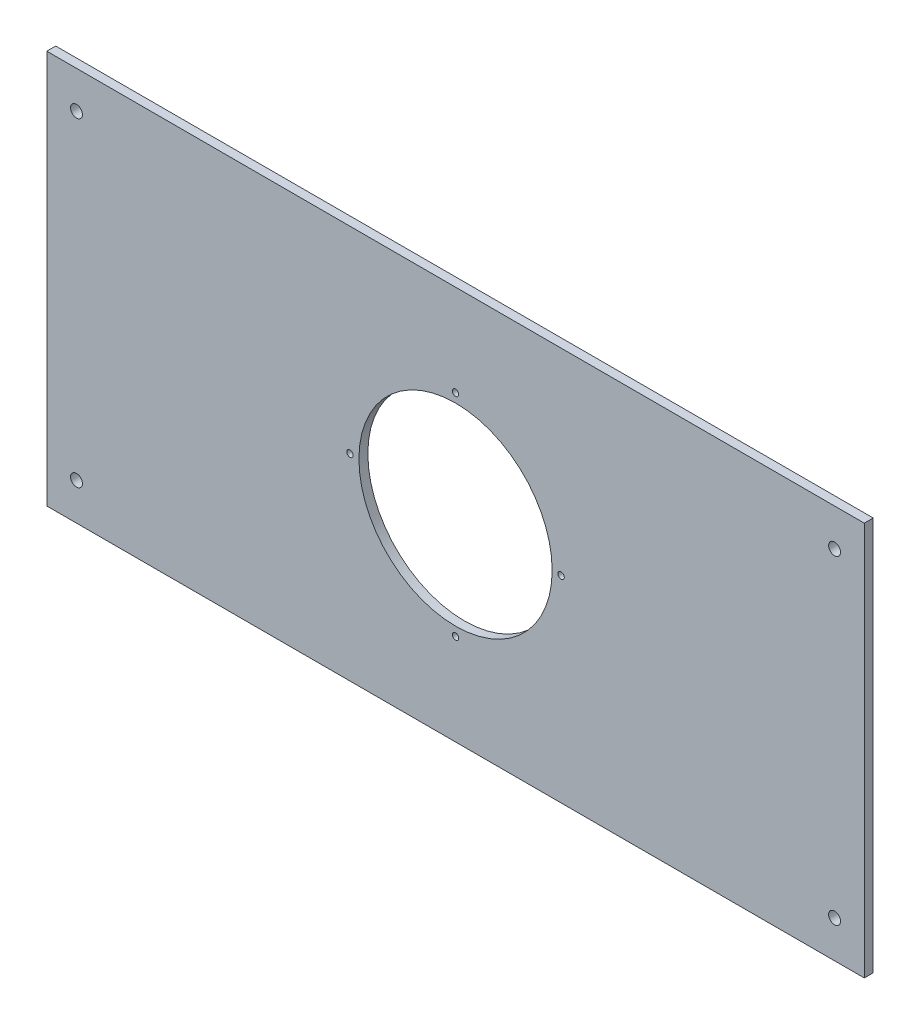
ISO-10303-21;
HEADER;
FILE_DESCRIPTION(('STEP AP214'),'2;1');
FILE_NAME('part.step','',(''),(''),'','','');
FILE_SCHEMA(('AUTOMOTIVE_DESIGN { 1 0 10303 214 1 1 1 1 }'));
ENDSEC;
DATA;
#1=APPLICATION_CONTEXT('core data for automotive mechanical design processes');
#2=APPLICATION_PROTOCOL_DEFINITION('international standard','automotive_design',2000,#1);
#3=PRODUCT_CONTEXT('',#1,'mechanical');
#4=PRODUCT('Part','Part','',(#3));
#5=PRODUCT_RELATED_PRODUCT_CATEGORY('part','',(#4));
#6=PRODUCT_DEFINITION_FORMATION('','',#4);
#7=PRODUCT_DEFINITION_CONTEXT('part definition',#1,'design');
#8=PRODUCT_DEFINITION('design','',#6,#7);
#9=PRODUCT_DEFINITION_SHAPE('','',#8);
#10=(LENGTH_UNIT() NAMED_UNIT(*) SI_UNIT(.MILLI.,.METRE.));
#11=(NAMED_UNIT(*) PLANE_ANGLE_UNIT() SI_UNIT($,.RADIAN.));
#12=(NAMED_UNIT(*) SI_UNIT($,.STERADIAN.) SOLID_ANGLE_UNIT());
#13=UNCERTAINTY_MEASURE_WITH_UNIT(LENGTH_MEASURE(1.E-05),#10,'distance_accuracy_value','');
#14=(GEOMETRIC_REPRESENTATION_CONTEXT(3) GLOBAL_UNCERTAINTY_ASSIGNED_CONTEXT((#13)) GLOBAL_UNIT_ASSIGNED_CONTEXT((#10,
#11,#12)) REPRESENTATION_CONTEXT('',''));
#15=CARTESIAN_POINT('',(0.,0.,0.));
#16=DIRECTION('',(0.,0.,1.));
#17=DIRECTION('',(1.,0.,0.));
#18=AXIS2_PLACEMENT_3D('',#15,#16,#17);
#19=CARTESIAN_POINT('',(-180.633802816901,158.529929577465,6.));
#20=DIRECTION('',(1.,0.,0.));
#21=DIRECTION('',(0.,1.,0.));
#22=AXIS2_PLACEMENT_3D('',#19,#20,#21);
#23=PLANE('',#22);
#24=DIRECTION('',(0.,-1.,0.));
#25=VECTOR('',#24,1.);
#26=CARTESIAN_POINT('',(-180.633802816901,158.529929577465,0.));
#27=LINE('',#26,#25);
#28=CARTESIAN_POINT('',(-180.633802816901,158.529929577465,0.));
#29=VERTEX_POINT('',#28);
#30=CARTESIAN_POINT('',(-180.633802816901,-106.470070422535,0.));
#31=VERTEX_POINT('',#30);
#32=EDGE_CURVE('E104',#29,#31,#27,.T.);
#33=ORIENTED_EDGE('',*,*,#32,.T.);
#34=DIRECTION('',(0.,0.,-1.));
#35=VECTOR('',#34,1.);
#36=CARTESIAN_POINT('',(-180.633802816901,-106.470070422535,6.));
#37=LINE('',#36,#35);
#38=CARTESIAN_POINT('',(-180.633802816901,-106.470070422535,6.));
#39=VERTEX_POINT('',#38);
#40=EDGE_CURVE('E11',#39,#31,#37,.T.);
#41=ORIENTED_EDGE('',*,*,#40,.F.);
#42=DIRECTION('',(0.,-1.,0.));
#43=VECTOR('',#42,1.);
#44=CARTESIAN_POINT('',(-180.633802816901,158.529929577465,6.));
#45=LINE('',#44,#43);
#46=CARTESIAN_POINT('',(-180.633802816901,158.529929577465,6.));
#47=VERTEX_POINT('',#46);
#48=EDGE_CURVE('E92',#47,#39,#45,.T.);
#49=ORIENTED_EDGE('',*,*,#48,.F.);
#50=DIRECTION('',(0.,0.,-1.));
#51=VECTOR('',#50,1.);
#52=CARTESIAN_POINT('',(-180.633802816901,158.529929577465,6.));
#53=LINE('',#52,#51);
#54=EDGE_CURVE('E100',#47,#29,#53,.T.);
#55=ORIENTED_EDGE('',*,*,#54,.T.);
#56=EDGE_LOOP('',(#33,#41,#49,#55));
#57=FACE_BOUND('',#56,.T.);
#58=ADVANCED_FACE('F41',(#57),#23,.F.);
#59=CARTESIAN_POINT('',(-180.633802816901,-106.470070422535,6.));
#60=DIRECTION('',(0.,1.,0.));
#61=DIRECTION('',(0.,0.,1.));
#62=AXIS2_PLACEMENT_3D('',#59,#60,#61);
#63=PLANE('',#62);
#64=DIRECTION('',(1.,0.,0.));
#65=VECTOR('',#64,1.);
#66=CARTESIAN_POINT('',(-180.633802816901,-106.470070422535,0.));
#67=LINE('',#66,#65);
#68=CARTESIAN_POINT('',(369.366197183099,-106.470070422535,0.));
#69=VERTEX_POINT('',#68);
#70=EDGE_CURVE('E96',#31,#69,#67,.T.);
#71=ORIENTED_EDGE('',*,*,#70,.T.);
#72=DIRECTION('',(0.,0.,-1.));
#73=VECTOR('',#72,1.);
#74=CARTESIAN_POINT('',(369.366197183099,-106.470070422535,6.));
#75=LINE('',#74,#73);
#76=CARTESIAN_POINT('',(369.366197183099,-106.470070422535,6.));
#77=VERTEX_POINT('',#76);
#78=EDGE_CURVE('E49',#77,#69,#75,.T.);
#79=ORIENTED_EDGE('',*,*,#78,.F.);
#80=DIRECTION('',(1.,0.,0.));
#81=VECTOR('',#80,1.);
#82=CARTESIAN_POINT('',(-180.633802816901,-106.470070422535,6.));
#83=LINE('',#82,#81);
#84=EDGE_CURVE('E87',#39,#77,#83,.T.);
#85=ORIENTED_EDGE('',*,*,#84,.F.);
#86=ORIENTED_EDGE('',*,*,#40,.T.);
#87=EDGE_LOOP('',(#71,#79,#85,#86));
#88=FACE_BOUND('',#87,.T.);
#89=ADVANCED_FACE('F95',(#88),#63,.F.);
#90=CARTESIAN_POINT('',(369.366197183099,158.529929577465,6.));
#91=DIRECTION('',(-1.,0.,0.));
#92=DIRECTION('',(0.,0.,1.));
#93=AXIS2_PLACEMENT_3D('',#90,#91,#92);
#94=PLANE('',#93);
#95=DIRECTION('',(0.,1.,0.));
#96=VECTOR('',#95,1.);
#97=CARTESIAN_POINT('',(369.366197183099,158.529929577465,0.));
#98=LINE('',#97,#96);
#99=CARTESIAN_POINT('',(369.366197183099,158.529929577465,0.));
#100=VERTEX_POINT('',#99);
#101=EDGE_CURVE('E74',#69,#100,#98,.T.);
#102=ORIENTED_EDGE('',*,*,#101,.T.);
#103=DIRECTION('',(0.,0.,-1.));
#104=VECTOR('',#103,1.);
#105=CARTESIAN_POINT('',(369.366197183099,158.529929577465,6.));
#106=LINE('',#105,#104);
#107=CARTESIAN_POINT('',(369.366197183099,158.529929577465,6.));
#108=VERTEX_POINT('',#107);
#109=EDGE_CURVE('E97',#108,#100,#106,.T.);
#110=ORIENTED_EDGE('',*,*,#109,.F.);
#111=DIRECTION('',(0.,1.,0.));
#112=VECTOR('',#111,1.);
#113=CARTESIAN_POINT('',(369.366197183099,158.529929577465,6.));
#114=LINE('',#113,#112);
#115=EDGE_CURVE('E90',#77,#108,#114,.T.);
#116=ORIENTED_EDGE('',*,*,#115,.F.);
#117=ORIENTED_EDGE('',*,*,#78,.T.);
#118=EDGE_LOOP('',(#102,#110,#116,#117));
#119=FACE_BOUND('',#118,.T.);
#120=ADVANCED_FACE('F98',(#119),#94,.F.);
#121=CARTESIAN_POINT('',(-180.633802816901,158.529929577465,6.));
#122=DIRECTION('',(0.,-1.,0.));
#123=DIRECTION('',(0.,0.,-1.));
#124=AXIS2_PLACEMENT_3D('',#121,#122,#123);
#125=PLANE('',#124);
#126=DIRECTION('',(-1.,0.,0.));
#127=VECTOR('',#126,1.);
#128=CARTESIAN_POINT('',(-180.633802816901,158.529929577465,0.));
#129=LINE('',#128,#127);
#130=EDGE_CURVE('E80',#100,#29,#129,.T.);
#131=ORIENTED_EDGE('',*,*,#130,.T.);
#132=ORIENTED_EDGE('',*,*,#54,.F.);
#133=DIRECTION('',(-1.,0.,0.));
#134=VECTOR('',#133,1.);
#135=CARTESIAN_POINT('',(-180.633802816901,158.529929577465,6.));
#136=LINE('',#135,#134);
#137=EDGE_CURVE('E57',#108,#47,#136,.T.);
#138=ORIENTED_EDGE('',*,*,#137,.F.);
#139=ORIENTED_EDGE('',*,*,#109,.T.);
#140=EDGE_LOOP('',(#131,#132,#138,#139));
#141=FACE_BOUND('',#140,.T.);
#142=ADVANCED_FACE('F112',(#141),#125,.F.);
#143=CARTESIAN_POINT('',(0.,0.,6.));
#144=DIRECTION('',(0.,0.,1.));
#145=DIRECTION('',(1.,0.,0.));
#146=AXIS2_PLACEMENT_3D('',#143,#144,#145);
#147=PLANE('',#146);
#148=CARTESIAN_POINT('',(94.3661971830987,97.0299295774648,6.));
#149=DIRECTION('',(0.,0.,1.));
#150=DIRECTION('',(1.,0.,0.));
#151=AXIS2_PLACEMENT_3D('',#148,#149,#150);
#152=CIRCLE('',#151,2.15);
#153=CARTESIAN_POINT('',(96.5161971830987,97.0299295774648,6.));
#154=VERTEX_POINT('',#153);
#155=EDGE_CURVE('E123',#154,#154,#152,.T.);
#156=ORIENTED_EDGE('',*,*,#155,.F.);
#157=EDGE_LOOP('',(#156));
#158=FACE_BOUND('',#157,.T.);
#159=CARTESIAN_POINT('',(-160.633802816901,133.529929577465,6.));
#160=DIRECTION('',(0.,0.,1.));
#161=DIRECTION('',(1.,0.,0.));
#162=AXIS2_PLACEMENT_3D('',#159,#160,#161);
#163=CIRCLE('',#162,3.99999999999999);
#164=CARTESIAN_POINT('',(-156.633802816901,133.529929577465,6.));
#165=VERTEX_POINT('',#164);
#166=EDGE_CURVE('E138',#165,#165,#163,.T.);
#167=ORIENTED_EDGE('',*,*,#166,.F.);
#168=EDGE_LOOP('',(#167));
#169=FACE_BOUND('',#168,.T.);
#170=CARTESIAN_POINT('',(165.366197183099,26.0299295774648,6.));
#171=DIRECTION('',(0.,0.,1.));
#172=DIRECTION('',(1.,0.,0.));
#173=AXIS2_PLACEMENT_3D('',#170,#171,#172);
#174=CIRCLE('',#173,2.15000000000002);
#175=CARTESIAN_POINT('',(167.516197183099,26.0299295774648,6.));
#176=VERTEX_POINT('',#175);
#177=EDGE_CURVE('E132',#176,#176,#174,.T.);
#178=ORIENTED_EDGE('',*,*,#177,.F.);
#179=EDGE_LOOP('',(#178));
#180=FACE_BOUND('',#179,.T.);
#181=CARTESIAN_POINT('',(94.3661971830987,-44.9700704225351,6.));
#182=DIRECTION('',(0.,0.,1.));
#183=DIRECTION('',(1.,0.,0.));
#184=AXIS2_PLACEMENT_3D('',#181,#182,#183);
#185=CIRCLE('',#184,2.15);
#186=CARTESIAN_POINT('',(96.5161971830987,-44.9700704225351,6.));
#187=VERTEX_POINT('',#186);
#188=EDGE_CURVE('E124',#187,#187,#185,.T.);
#189=ORIENTED_EDGE('',*,*,#188,.F.);
#190=EDGE_LOOP('',(#189));
#191=FACE_BOUND('',#190,.T.);
#192=CARTESIAN_POINT('',(23.3661971830987,26.0299295774648,6.));
#193=DIRECTION('',(0.,0.,1.));
#194=DIRECTION('',(1.,0.,0.));
#195=AXIS2_PLACEMENT_3D('',#192,#193,#194);
#196=CIRCLE('',#195,2.15000000000001);
#197=CARTESIAN_POINT('',(25.5161971830987,26.0299295774648,6.));
#198=VERTEX_POINT('',#197);
#199=EDGE_CURVE('E131',#198,#198,#196,.T.);
#200=ORIENTED_EDGE('',*,*,#199,.F.);
#201=EDGE_LOOP('',(#200));
#202=FACE_BOUND('',#201,.T.);
#203=CARTESIAN_POINT('',(349.366197183099,133.529929577465,6.));
#204=DIRECTION('',(0.,0.,1.));
#205=DIRECTION('',(-1.,0.,0.));
#206=AXIS2_PLACEMENT_3D('',#203,#204,#205);
#207=CIRCLE('',#206,3.99999999999999);
#208=CARTESIAN_POINT('',(345.366197183099,133.529929577465,6.));
#209=VERTEX_POINT('',#208);
#210=EDGE_CURVE('E161',#209,#209,#207,.T.);
#211=ORIENTED_EDGE('',*,*,#210,.F.);
#212=EDGE_LOOP('',(#211));
#213=FACE_BOUND('',#212,.T.);
#214=CARTESIAN_POINT('',(349.366197183099,-81.4700704225355,6.));
#215=DIRECTION('',(0.,0.,1.));
#216=DIRECTION('',(1.,0.,0.));
#217=AXIS2_PLACEMENT_3D('',#214,#215,#216);
#218=CIRCLE('',#217,3.99999999999999);
#219=CARTESIAN_POINT('',(353.366197183099,-81.4700704225355,6.));
#220=VERTEX_POINT('',#219);
#221=EDGE_CURVE('E155',#220,#220,#218,.T.);
#222=ORIENTED_EDGE('',*,*,#221,.F.);
#223=EDGE_LOOP('',(#222));
#224=FACE_BOUND('',#223,.T.);
#225=CARTESIAN_POINT('',(-160.633802816901,-81.4700704225353,6.));
#226=DIRECTION('',(0.,0.,1.));
#227=DIRECTION('',(-1.,0.,0.));
#228=AXIS2_PLACEMENT_3D('',#225,#226,#227);
#229=CIRCLE('',#228,3.99999999999999);
#230=CARTESIAN_POINT('',(-164.633802816901,-81.4700704225353,6.));
#231=VERTEX_POINT('',#230);
#232=EDGE_CURVE('E148',#231,#231,#229,.T.);
#233=ORIENTED_EDGE('',*,*,#232,.F.);
#234=EDGE_LOOP('',(#233));
#235=FACE_BOUND('',#234,.T.);
#236=CARTESIAN_POINT('',(94.3661971830987,26.0299295774648,6.));
#237=DIRECTION('',(0.,0.,1.));
#238=DIRECTION('',(1.,0.,0.));
#239=AXIS2_PLACEMENT_3D('',#236,#237,#238);
#240=CIRCLE('',#239,65.);
#241=CARTESIAN_POINT('',(159.366197183099,26.0299295774648,6.));
#242=VERTEX_POINT('',#241);
#243=EDGE_CURVE('E120',#242,#242,#240,.T.);
#244=ORIENTED_EDGE('',*,*,#243,.F.);
#245=EDGE_LOOP('',(#244));
#246=FACE_BOUND('',#245,.T.);
#247=ORIENTED_EDGE('',*,*,#48,.T.);
#248=ORIENTED_EDGE('',*,*,#84,.T.);
#249=ORIENTED_EDGE('',*,*,#115,.T.);
#250=ORIENTED_EDGE('',*,*,#137,.T.);
#251=EDGE_LOOP('',(#247,#248,#249,#250));
#252=FACE_BOUND('',#251,.T.);
#253=ADVANCED_FACE('F88',(#158,#169,#180,#191,#202,#213,#224,#235,#246,#252),#147,.T.);
#254=CARTESIAN_POINT('',(0.,0.,0.));
#255=DIRECTION('',(0.,0.,1.));
#256=DIRECTION('',(1.,0.,0.));
#257=AXIS2_PLACEMENT_3D('',#254,#255,#256);
#258=PLANE('',#257);
#259=CARTESIAN_POINT('',(94.3661971830987,97.0299295774648,0.));
#260=DIRECTION('',(0.,0.,1.));
#261=DIRECTION('',(1.,0.,0.));
#262=AXIS2_PLACEMENT_3D('',#259,#260,#261);
#263=CIRCLE('',#262,2.15);
#264=CARTESIAN_POINT('',(96.5161971830987,97.0299295774648,0.));
#265=VERTEX_POINT('',#264);
#266=EDGE_CURVE('E141',#265,#265,#263,.F.);
#267=ORIENTED_EDGE('',*,*,#266,.F.);
#268=EDGE_LOOP('',(#267));
#269=FACE_BOUND('',#268,.T.);
#270=CARTESIAN_POINT('',(-160.633802816901,133.529929577465,0.));
#271=DIRECTION('',(0.,0.,1.));
#272=DIRECTION('',(1.,0.,0.));
#273=AXIS2_PLACEMENT_3D('',#270,#271,#272);
#274=CIRCLE('',#273,3.99999999999999);
#275=CARTESIAN_POINT('',(-156.633802816901,133.529929577465,0.));
#276=VERTEX_POINT('',#275);
#277=EDGE_CURVE('E135',#276,#276,#274,.F.);
#278=ORIENTED_EDGE('',*,*,#277,.F.);
#279=EDGE_LOOP('',(#278));
#280=FACE_BOUND('',#279,.T.);
#281=CARTESIAN_POINT('',(165.366197183099,26.0299295774648,0.));
#282=DIRECTION('',(0.,0.,1.));
#283=DIRECTION('',(1.,0.,0.));
#284=AXIS2_PLACEMENT_3D('',#281,#282,#283);
#285=CIRCLE('',#284,2.15000000000002);
#286=CARTESIAN_POINT('',(167.516197183099,26.0299295774648,0.));
#287=VERTEX_POINT('',#286);
#288=EDGE_CURVE('E127',#287,#287,#285,.F.);
#289=ORIENTED_EDGE('',*,*,#288,.F.);
#290=EDGE_LOOP('',(#289));
#291=FACE_BOUND('',#290,.T.);
#292=CARTESIAN_POINT('',(94.3661971830987,-44.9700704225351,0.));
#293=DIRECTION('',(0.,0.,1.));
#294=DIRECTION('',(1.,0.,0.));
#295=AXIS2_PLACEMENT_3D('',#292,#293,#294);
#296=CIRCLE('',#295,2.15);
#297=CARTESIAN_POINT('',(96.5161971830987,-44.9700704225351,0.));
#298=VERTEX_POINT('',#297);
#299=EDGE_CURVE('E128',#298,#298,#296,.F.);
#300=ORIENTED_EDGE('',*,*,#299,.F.);
#301=EDGE_LOOP('',(#300));
#302=FACE_BOUND('',#301,.T.);
#303=CARTESIAN_POINT('',(23.3661971830987,26.0299295774648,0.));
#304=DIRECTION('',(0.,0.,1.));
#305=DIRECTION('',(1.,0.,0.));
#306=AXIS2_PLACEMENT_3D('',#303,#304,#305);
#307=CIRCLE('',#306,2.15000000000001);
#308=CARTESIAN_POINT('',(25.5161971830987,26.0299295774648,0.));
#309=VERTEX_POINT('',#308);
#310=EDGE_CURVE('E164',#309,#309,#307,.F.);
#311=ORIENTED_EDGE('',*,*,#310,.F.);
#312=EDGE_LOOP('',(#311));
#313=FACE_BOUND('',#312,.T.);
#314=CARTESIAN_POINT('',(349.366197183099,133.529929577465,0.));
#315=DIRECTION('',(0.,0.,1.));
#316=DIRECTION('',(1.,0.,0.));
#317=AXIS2_PLACEMENT_3D('',#314,#315,#316);
#318=CIRCLE('',#317,3.99999999999999);
#319=CARTESIAN_POINT('',(353.366197183099,133.529929577465,0.));
#320=VERTEX_POINT('',#319);
#321=EDGE_CURVE('E158',#320,#320,#318,.F.);
#322=ORIENTED_EDGE('',*,*,#321,.F.);
#323=EDGE_LOOP('',(#322));
#324=FACE_BOUND('',#323,.T.);
#325=CARTESIAN_POINT('',(349.366197183099,-81.4700704225355,0.));
#326=DIRECTION('',(0.,0.,1.));
#327=DIRECTION('',(1.,0.,0.));
#328=AXIS2_PLACEMENT_3D('',#325,#326,#327);
#329=CIRCLE('',#328,3.99999999999999);
#330=CARTESIAN_POINT('',(353.366197183099,-81.4700704225355,0.));
#331=VERTEX_POINT('',#330);
#332=EDGE_CURVE('E151',#331,#331,#329,.F.);
#333=ORIENTED_EDGE('',*,*,#332,.F.);
#334=EDGE_LOOP('',(#333));
#335=FACE_BOUND('',#334,.T.);
#336=CARTESIAN_POINT('',(-160.633802816901,-81.4700704225353,0.));
#337=DIRECTION('',(0.,0.,1.));
#338=DIRECTION('',(1.,0.,0.));
#339=AXIS2_PLACEMENT_3D('',#336,#337,#338);
#340=CIRCLE('',#339,3.99999999999999);
#341=CARTESIAN_POINT('',(-156.633802816901,-81.4700704225353,0.));
#342=VERTEX_POINT('',#341);
#343=EDGE_CURVE('E152',#342,#342,#340,.F.);
#344=ORIENTED_EDGE('',*,*,#343,.F.);
#345=EDGE_LOOP('',(#344));
#346=FACE_BOUND('',#345,.T.);
#347=CARTESIAN_POINT('',(94.3661971830987,26.0299295774648,0.));
#348=DIRECTION('',(0.,0.,1.));
#349=DIRECTION('',(1.,0.,0.));
#350=AXIS2_PLACEMENT_3D('',#347,#348,#349);
#351=CIRCLE('',#350,65.);
#352=CARTESIAN_POINT('',(159.366197183099,26.0299295774648,0.));
#353=VERTEX_POINT('',#352);
#354=EDGE_CURVE('E107',#353,#353,#351,.F.);
#355=ORIENTED_EDGE('',*,*,#354,.F.);
#356=EDGE_LOOP('',(#355));
#357=FACE_BOUND('',#356,.T.);
#358=ORIENTED_EDGE('',*,*,#32,.F.);
#359=ORIENTED_EDGE('',*,*,#130,.F.);
#360=ORIENTED_EDGE('',*,*,#101,.F.);
#361=ORIENTED_EDGE('',*,*,#70,.F.);
#362=EDGE_LOOP('',(#358,#359,#360,#361));
#363=FACE_BOUND('',#362,.T.);
#364=ADVANCED_FACE('F115',(#269,#280,#291,#302,#313,#324,#335,#346,#357,#363),#258,.F.);
#365=CARTESIAN_POINT('',(94.3661971830987,26.0299295774648,-183.847763108502));
#366=DIRECTION('',(0.,0.,1.));
#367=DIRECTION('',(1.,0.,0.));
#368=AXIS2_PLACEMENT_3D('',#365,#366,#367);
#369=CYLINDRICAL_SURFACE('',#368,65.);
#370=ORIENTED_EDGE('',*,*,#354,.T.);
#371=EDGE_LOOP('',(#370));
#372=FACE_BOUND('',#371,.T.);
#373=ORIENTED_EDGE('',*,*,#243,.T.);
#374=EDGE_LOOP('',(#373));
#375=FACE_BOUND('',#374,.T.);
#376=ADVANCED_FACE('F177',(#372,#375),#369,.F.);
#377=CARTESIAN_POINT('',(-160.633802816901,-81.4700704225353,-183.847763108502));
#378=DIRECTION('',(0.,0.,1.));
#379=DIRECTION('',(1.,0.,0.));
#380=AXIS2_PLACEMENT_3D('',#377,#378,#379);
#381=CYLINDRICAL_SURFACE('',#380,3.99999999999999);
#382=ORIENTED_EDGE('',*,*,#343,.T.);
#383=EDGE_LOOP('',(#382));
#384=FACE_BOUND('',#383,.T.);
#385=ORIENTED_EDGE('',*,*,#232,.T.);
#386=EDGE_LOOP('',(#385));
#387=FACE_BOUND('',#386,.T.);
#388=ADVANCED_FACE('F190',(#384,#387),#381,.F.);
#389=CARTESIAN_POINT('',(349.366197183099,-81.4700704225355,-183.847763108502));
#390=DIRECTION('',(0.,0.,1.));
#391=DIRECTION('',(1.,0.,0.));
#392=AXIS2_PLACEMENT_3D('',#389,#390,#391);
#393=CYLINDRICAL_SURFACE('',#392,3.99999999999999);
#394=ORIENTED_EDGE('',*,*,#332,.T.);
#395=EDGE_LOOP('',(#394));
#396=FACE_BOUND('',#395,.T.);
#397=ORIENTED_EDGE('',*,*,#221,.T.);
#398=EDGE_LOOP('',(#397));
#399=FACE_BOUND('',#398,.T.);
#400=ADVANCED_FACE('F244',(#396,#399),#393,.F.);
#401=CARTESIAN_POINT('',(349.366197183099,133.529929577465,-183.847763108502));
#402=DIRECTION('',(0.,0.,1.));
#403=DIRECTION('',(1.,0.,0.));
#404=AXIS2_PLACEMENT_3D('',#401,#402,#403);
#405=CYLINDRICAL_SURFACE('',#404,3.99999999999999);
#406=ORIENTED_EDGE('',*,*,#321,.T.);
#407=EDGE_LOOP('',(#406));
#408=FACE_BOUND('',#407,.T.);
#409=ORIENTED_EDGE('',*,*,#210,.T.);
#410=EDGE_LOOP('',(#409));
#411=FACE_BOUND('',#410,.T.);
#412=ADVANCED_FACE('F254',(#408,#411),#405,.F.);
#413=CARTESIAN_POINT('',(23.3661971830987,26.0299295774648,-183.847763108502));
#414=DIRECTION('',(0.,0.,1.));
#415=DIRECTION('',(1.,0.,0.));
#416=AXIS2_PLACEMENT_3D('',#413,#414,#415);
#417=CYLINDRICAL_SURFACE('',#416,2.15000000000001);
#418=ORIENTED_EDGE('',*,*,#310,.T.);
#419=EDGE_LOOP('',(#418));
#420=FACE_BOUND('',#419,.T.);
#421=ORIENTED_EDGE('',*,*,#199,.T.);
#422=EDGE_LOOP('',(#421));
#423=FACE_BOUND('',#422,.T.);
#424=ADVANCED_FACE('F172',(#420,#423),#417,.F.);
#425=CARTESIAN_POINT('',(94.3661971830987,-44.9700704225351,-183.847763108502));
#426=DIRECTION('',(0.,0.,1.));
#427=DIRECTION('',(1.,0.,0.));
#428=AXIS2_PLACEMENT_3D('',#425,#426,#427);
#429=CYLINDRICAL_SURFACE('',#428,2.15);
#430=ORIENTED_EDGE('',*,*,#299,.T.);
#431=EDGE_LOOP('',(#430));
#432=FACE_BOUND('',#431,.T.);
#433=ORIENTED_EDGE('',*,*,#188,.T.);
#434=EDGE_LOOP('',(#433));
#435=FACE_BOUND('',#434,.T.);
#436=ADVANCED_FACE('F273',(#432,#435),#429,.F.);
#437=CARTESIAN_POINT('',(165.366197183099,26.0299295774648,-183.847763108502));
#438=DIRECTION('',(0.,0.,1.));
#439=DIRECTION('',(1.,0.,0.));
#440=AXIS2_PLACEMENT_3D('',#437,#438,#439);
#441=CYLINDRICAL_SURFACE('',#440,2.15000000000002);
#442=ORIENTED_EDGE('',*,*,#288,.T.);
#443=EDGE_LOOP('',(#442));
#444=FACE_BOUND('',#443,.T.);
#445=ORIENTED_EDGE('',*,*,#177,.T.);
#446=EDGE_LOOP('',(#445));
#447=FACE_BOUND('',#446,.T.);
#448=ADVANCED_FACE('F282',(#444,#447),#441,.F.);
#449=CARTESIAN_POINT('',(-160.633802816901,133.529929577465,-183.847763108502));
#450=DIRECTION('',(0.,0.,1.));
#451=DIRECTION('',(1.,0.,0.));
#452=AXIS2_PLACEMENT_3D('',#449,#450,#451);
#453=CYLINDRICAL_SURFACE('',#452,3.99999999999999);
#454=ORIENTED_EDGE('',*,*,#277,.T.);
#455=EDGE_LOOP('',(#454));
#456=FACE_BOUND('',#455,.T.);
#457=ORIENTED_EDGE('',*,*,#166,.T.);
#458=EDGE_LOOP('',(#457));
#459=FACE_BOUND('',#458,.T.);
#460=ADVANCED_FACE('F292',(#456,#459),#453,.F.);
#461=CARTESIAN_POINT('',(94.3661971830987,97.0299295774648,-183.847763108502));
#462=DIRECTION('',(0.,0.,1.));
#463=DIRECTION('',(1.,0.,0.));
#464=AXIS2_PLACEMENT_3D('',#461,#462,#463);
#465=CYLINDRICAL_SURFACE('',#464,2.15);
#466=ORIENTED_EDGE('',*,*,#266,.T.);
#467=EDGE_LOOP('',(#466));
#468=FACE_BOUND('',#467,.T.);
#469=ORIENTED_EDGE('',*,*,#155,.T.);
#470=EDGE_LOOP('',(#469));
#471=FACE_BOUND('',#470,.T.);
#472=ADVANCED_FACE('F302',(#468,#471),#465,.F.);
#473=CLOSED_SHELL('',(#58,#89,#120,#142,#253,#364,#376,#388,#400,#412,#424,#436,#448,#460,#472));
#474=MANIFOLD_SOLID_BREP('B2',#473);
#475=ADVANCED_BREP_SHAPE_REPRESENTATION('',(#18,#474),#14);
#476=SHAPE_DEFINITION_REPRESENTATION(#9,#475);
ENDSEC;
END-ISO-10303-21;
